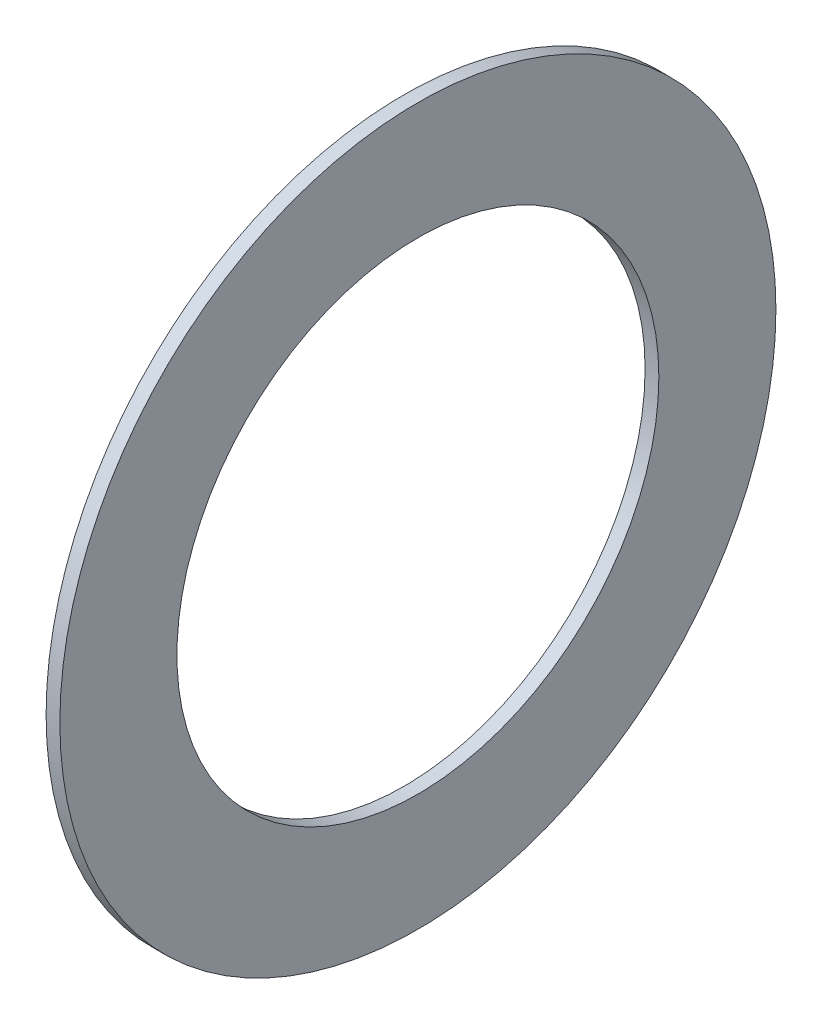
ISO-10303-21;
HEADER;
FILE_DESCRIPTION(('STEP AP214'),'2;1');
FILE_NAME('part.step','',(''),(''),'','','');
FILE_SCHEMA(('AUTOMOTIVE_DESIGN { 1 0 10303 214 1 1 1 1 }'));
ENDSEC;
DATA;
#1=APPLICATION_CONTEXT('core data for automotive mechanical design processes');
#2=APPLICATION_PROTOCOL_DEFINITION('international standard','automotive_design',2000,#1);
#3=PRODUCT_CONTEXT('',#1,'mechanical');
#4=PRODUCT('Part','Part','',(#3));
#5=PRODUCT_RELATED_PRODUCT_CATEGORY('part','',(#4));
#6=PRODUCT_DEFINITION_FORMATION('','',#4);
#7=PRODUCT_DEFINITION_CONTEXT('part definition',#1,'design');
#8=PRODUCT_DEFINITION('design','',#6,#7);
#9=PRODUCT_DEFINITION_SHAPE('','',#8);
#10=(LENGTH_UNIT() NAMED_UNIT(*) SI_UNIT(.MILLI.,.METRE.));
#11=(NAMED_UNIT(*) PLANE_ANGLE_UNIT() SI_UNIT($,.RADIAN.));
#12=(NAMED_UNIT(*) SI_UNIT($,.STERADIAN.) SOLID_ANGLE_UNIT());
#13=UNCERTAINTY_MEASURE_WITH_UNIT(LENGTH_MEASURE(1.E-05),#10,'distance_accuracy_value','');
#14=(GEOMETRIC_REPRESENTATION_CONTEXT(3) GLOBAL_UNCERTAINTY_ASSIGNED_CONTEXT((#13)) GLOBAL_UNIT_ASSIGNED_CONTEXT((#10,
#11,#12)) REPRESENTATION_CONTEXT('',''));
#15=CARTESIAN_POINT('',(0.,0.,0.));
#16=DIRECTION('',(0.,0.,1.));
#17=DIRECTION('',(1.,0.,0.));
#18=AXIS2_PLACEMENT_3D('',#15,#16,#17);
#19=CARTESIAN_POINT('',(1.,0.,0.));
#20=DIRECTION('',(1.,0.,0.));
#21=DIRECTION('',(0.,0.,-1.));
#22=AXIS2_PLACEMENT_3D('',#19,#20,#21);
#23=PLANE('',#22);
#24=CARTESIAN_POINT('',(1.,0.,0.));
#25=DIRECTION('',(1.,0.,0.));
#26=DIRECTION('',(0.,0.,-1.));
#27=AXIS2_PLACEMENT_3D('',#24,#25,#26);
#28=CIRCLE('',#27,26.);
#29=CARTESIAN_POINT('',(1.,0.,-26.));
#30=VERTEX_POINT('',#29);
#31=EDGE_CURVE('E10',#30,#30,#28,.T.);
#32=ORIENTED_EDGE('',*,*,#31,.T.);
#33=EDGE_LOOP('',(#32));
#34=FACE_BOUND('',#33,.T.);
#35=CARTESIAN_POINT('',(1.,0.,0.));
#36=DIRECTION('',(1.,0.,0.));
#37=DIRECTION('',(0.,0.,-1.));
#38=AXIS2_PLACEMENT_3D('',#35,#36,#37);
#39=CIRCLE('',#38,17.5);
#40=CARTESIAN_POINT('',(1.,0.,-17.5));
#41=VERTEX_POINT('',#40);
#42=EDGE_CURVE('E46',#41,#41,#39,.T.);
#43=ORIENTED_EDGE('',*,*,#42,.F.);
#44=EDGE_LOOP('',(#43));
#45=FACE_BOUND('',#44,.T.);
#46=ADVANCED_FACE('F35',(#34,#45),#23,.T.);
#47=CARTESIAN_POINT('',(0.,0.,0.));
#48=DIRECTION('',(1.,0.,0.));
#49=DIRECTION('',(0.,0.,-1.));
#50=AXIS2_PLACEMENT_3D('',#47,#48,#49);
#51=PLANE('',#50);
#52=CARTESIAN_POINT('',(0.,0.,0.));
#53=DIRECTION('',(1.,0.,0.));
#54=DIRECTION('',(0.,0.,-1.));
#55=AXIS2_PLACEMENT_3D('',#52,#53,#54);
#56=CIRCLE('',#55,26.);
#57=CARTESIAN_POINT('',(0.,0.,-26.));
#58=VERTEX_POINT('',#57);
#59=EDGE_CURVE('E39',#58,#58,#56,.T.);
#60=ORIENTED_EDGE('',*,*,#59,.F.);
#61=EDGE_LOOP('',(#60));
#62=FACE_BOUND('',#61,.T.);
#63=CARTESIAN_POINT('',(0.,0.,0.));
#64=DIRECTION('',(1.,0.,0.));
#65=DIRECTION('',(0.,0.,-1.));
#66=AXIS2_PLACEMENT_3D('',#63,#64,#65);
#67=CIRCLE('',#66,17.5);
#68=CARTESIAN_POINT('',(0.,0.,-17.5));
#69=VERTEX_POINT('',#68);
#70=EDGE_CURVE('E48',#69,#69,#67,.T.);
#71=ORIENTED_EDGE('',*,*,#70,.T.);
#72=EDGE_LOOP('',(#71));
#73=FACE_BOUND('',#72,.T.);
#74=ADVANCED_FACE('F58',(#62,#73),#51,.F.);
#75=CARTESIAN_POINT('',(1.,0.,0.));
#76=DIRECTION('',(-1.,0.,0.));
#77=DIRECTION('',(0.,0.,1.));
#78=AXIS2_PLACEMENT_3D('',#75,#76,#77);
#79=CYLINDRICAL_SURFACE('',#78,26.);
#80=ORIENTED_EDGE('',*,*,#31,.F.);
#81=EDGE_LOOP('',(#80));
#82=FACE_BOUND('',#81,.T.);
#83=ORIENTED_EDGE('',*,*,#59,.T.);
#84=EDGE_LOOP('',(#83));
#85=FACE_BOUND('',#84,.T.);
#86=ADVANCED_FACE('F37',(#82,#85),#79,.T.);
#87=CARTESIAN_POINT('',(1.,0.,0.));
#88=DIRECTION('',(-1.,0.,0.));
#89=DIRECTION('',(0.,0.,1.));
#90=AXIS2_PLACEMENT_3D('',#87,#88,#89);
#91=CYLINDRICAL_SURFACE('',#90,17.5);
#92=ORIENTED_EDGE('',*,*,#42,.T.);
#93=EDGE_LOOP('',(#92));
#94=FACE_BOUND('',#93,.T.);
#95=ORIENTED_EDGE('',*,*,#70,.F.);
#96=EDGE_LOOP('',(#95));
#97=FACE_BOUND('',#96,.T.);
#98=ADVANCED_FACE('F54',(#94,#97),#91,.F.);
#99=CLOSED_SHELL('',(#46,#74,#86,#98));
#100=MANIFOLD_SOLID_BREP('B2',#99);
#101=ADVANCED_BREP_SHAPE_REPRESENTATION('',(#18,#100),#14);
#102=SHAPE_DEFINITION_REPRESENTATION(#9,#101);
ENDSEC;
END-ISO-10303-21;
